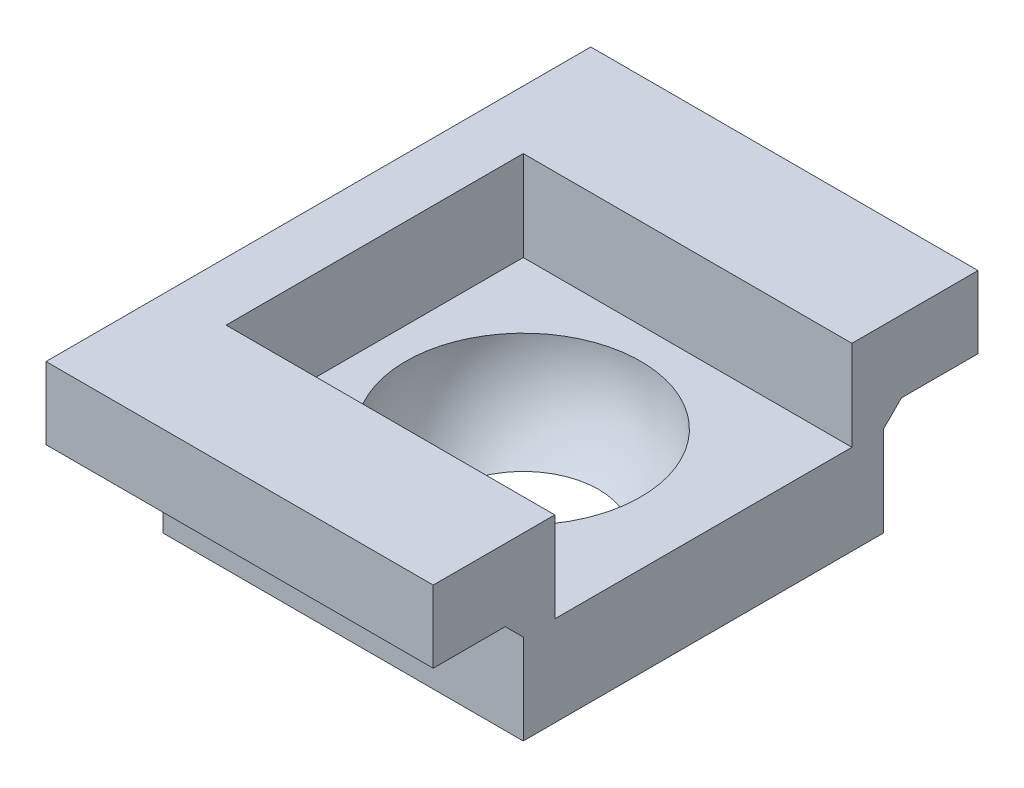
ISO-10303-21;
HEADER;
FILE_DESCRIPTION(('STEP AP214'),'2;1');
FILE_NAME('part.step','',(''),(''),'','','');
FILE_SCHEMA(('AUTOMOTIVE_DESIGN { 1 0 10303 214 1 1 1 1 }'));
ENDSEC;
DATA;
#1=APPLICATION_CONTEXT('core data for automotive mechanical design processes');
#2=APPLICATION_PROTOCOL_DEFINITION('international standard','automotive_design',2000,#1);
#3=PRODUCT_CONTEXT('',#1,'mechanical');
#4=PRODUCT('Part','Part','',(#3));
#5=PRODUCT_RELATED_PRODUCT_CATEGORY('part','',(#4));
#6=PRODUCT_DEFINITION_FORMATION('','',#4);
#7=PRODUCT_DEFINITION_CONTEXT('part definition',#1,'design');
#8=PRODUCT_DEFINITION('design','',#6,#7);
#9=PRODUCT_DEFINITION_SHAPE('','',#8);
#10=(LENGTH_UNIT() NAMED_UNIT(*) SI_UNIT(.MILLI.,.METRE.));
#11=(NAMED_UNIT(*) PLANE_ANGLE_UNIT() SI_UNIT($,.RADIAN.));
#12=(NAMED_UNIT(*) SI_UNIT($,.STERADIAN.) SOLID_ANGLE_UNIT());
#13=UNCERTAINTY_MEASURE_WITH_UNIT(LENGTH_MEASURE(1.E-05),#10,'distance_accuracy_value','');
#14=(GEOMETRIC_REPRESENTATION_CONTEXT(3) GLOBAL_UNCERTAINTY_ASSIGNED_CONTEXT((#13)) GLOBAL_UNIT_ASSIGNED_CONTEXT((#10,
#11,#12)) REPRESENTATION_CONTEXT('',''));
#15=CARTESIAN_POINT('',(0.,0.,0.));
#16=DIRECTION('',(0.,0.,1.));
#17=DIRECTION('',(1.,0.,0.));
#18=AXIS2_PLACEMENT_3D('',#15,#16,#17);
#19=CARTESIAN_POINT('',(-2.30598444461534,2.,-2.01602049593134));
#20=DIRECTION('',(1.,0.,0.));
#21=DIRECTION('',(0.,0.,-1.));
#22=AXIS2_PLACEMENT_3D('',#19,#20,#21);
#23=PLANE('',#22);
#24=DIRECTION('',(0.,0.,1.));
#25=VECTOR('',#24,1.);
#26=CARTESIAN_POINT('',(-2.30598444461534,2.2,-3.06602049593131));
#27=LINE('',#26,#25);
#28=CARTESIAN_POINT('',(-2.30598444461534,2.2,-2.21602049593134));
#29=VERTEX_POINT('',#28);
#30=CARTESIAN_POINT('',(-2.30598444461534,2.2,2.18397950406866));
#31=VERTEX_POINT('',#30);
#32=EDGE_CURVE('E45',#29,#31,#27,.T.);
#33=ORIENTED_EDGE('',*,*,#32,.F.);
#34=DIRECTION('',(0.,-0.707106781186548,0.707106781186548));
#35=VECTOR('',#34,1.);
#36=CARTESIAN_POINT('',(-2.30598444461534,2.,-2.01602049593134));
#37=LINE('',#36,#35);
#38=CARTESIAN_POINT('',(-2.30598444461534,2.,-2.01602049593134));
#39=VERTEX_POINT('',#38);
#40=EDGE_CURVE('E138',#29,#39,#37,.T.);
#41=ORIENTED_EDGE('',*,*,#40,.T.);
#42=DIRECTION('',(0.,-1.,0.));
#43=VECTOR('',#42,1.);
#44=CARTESIAN_POINT('',(-2.30598444461534,2.,-2.01602049593134));
#45=LINE('',#44,#43);
#46=CARTESIAN_POINT('',(-2.30598444461534,1.,-2.01602049593134));
#47=VERTEX_POINT('',#46);
#48=EDGE_CURVE('E57',#39,#47,#45,.T.);
#49=ORIENTED_EDGE('',*,*,#48,.T.);
#50=DIRECTION('',(0.,0.,-1.));
#51=VECTOR('',#50,1.);
#52=CARTESIAN_POINT('',(-2.30598444461534,1.,-2.01602049593134));
#53=LINE('',#52,#51);
#54=CARTESIAN_POINT('',(-2.30598444461534,1.,1.98397950406866));
#55=VERTEX_POINT('',#54);
#56=EDGE_CURVE('E239',#55,#47,#53,.T.);
#57=ORIENTED_EDGE('',*,*,#56,.F.);
#58=DIRECTION('',(0.,-1.,0.));
#59=VECTOR('',#58,1.);
#60=CARTESIAN_POINT('',(-2.30598444461534,2.,1.98397950406866));
#61=LINE('',#60,#59);
#62=CARTESIAN_POINT('',(-2.30598444461534,2.,1.98397950406866));
#63=VERTEX_POINT('',#62);
#64=EDGE_CURVE('E144',#63,#55,#61,.T.);
#65=ORIENTED_EDGE('',*,*,#64,.F.);
#66=DIRECTION('',(0.,0.707106781186548,0.707106781186548));
#67=VECTOR('',#66,1.);
#68=CARTESIAN_POINT('',(-2.30598444461534,2.,1.98397950406866));
#69=LINE('',#68,#67);
#70=EDGE_CURVE('E141',#63,#31,#69,.T.);
#71=ORIENTED_EDGE('',*,*,#70,.T.);
#72=EDGE_LOOP('',(#33,#41,#49,#57,#65,#71));
#73=FACE_BOUND('',#72,.T.);
#74=ADVANCED_FACE('F38',(#73),#23,.F.);
#75=CARTESIAN_POINT('',(-2.30598444461534,2.,1.98397950406866));
#76=DIRECTION('',(0.,0.,-1.));
#77=DIRECTION('',(-1.,0.,0.));
#78=AXIS2_PLACEMENT_3D('',#75,#76,#77);
#79=PLANE('',#78);
#80=DIRECTION('',(0.,-1.,0.));
#81=VECTOR('',#80,1.);
#82=CARTESIAN_POINT('',(1.69401555538466,2.,1.98397950406866));
#83=LINE('',#82,#81);
#84=CARTESIAN_POINT('',(1.69401555538466,2.,1.98397950406866));
#85=VERTEX_POINT('',#84);
#86=CARTESIAN_POINT('',(1.69401555538466,1.,1.98397950406866));
#87=VERTEX_POINT('',#86);
#88=EDGE_CURVE('E248',#85,#87,#83,.T.);
#89=ORIENTED_EDGE('',*,*,#88,.F.);
#90=DIRECTION('',(1.,0.,0.));
#91=VECTOR('',#90,1.);
#92=CARTESIAN_POINT('',(-2.58882715708996,2.,1.98397950406866));
#93=LINE('',#92,#91);
#94=EDGE_CURVE('E166',#63,#85,#93,.T.);
#95=ORIENTED_EDGE('',*,*,#94,.F.);
#96=ORIENTED_EDGE('',*,*,#64,.T.);
#97=DIRECTION('',(-1.,0.,0.));
#98=VECTOR('',#97,1.);
#99=CARTESIAN_POINT('',(-2.30598444461534,1.,1.98397950406866));
#100=LINE('',#99,#98);
#101=EDGE_CURVE('E236',#87,#55,#100,.T.);
#102=ORIENTED_EDGE('',*,*,#101,.F.);
#103=EDGE_LOOP('',(#89,#95,#96,#102));
#104=FACE_BOUND('',#103,.T.);
#105=ADVANCED_FACE('F269',(#104),#79,.F.);
#106=CARTESIAN_POINT('',(0.,2.,0.));
#107=DIRECTION('',(0.,1.,0.));
#108=DIRECTION('',(0.,0.,1.));
#109=AXIS2_PLACEMENT_3D('',#106,#107,#108);
#110=PLANE('',#109);
#111=DIRECTION('',(0.,0.,-1.));
#112=VECTOR('',#111,1.);
#113=CARTESIAN_POINT('',(1.69401555538466,2.,-2.01602049593134));
#114=LINE('',#113,#112);
#115=CARTESIAN_POINT('',(1.69401555538466,2.,1.63397950406866));
#116=VERTEX_POINT('',#115);
#117=CARTESIAN_POINT('',(1.69401555538466,2.,-1.66602049593134));
#118=VERTEX_POINT('',#117);
#119=EDGE_CURVE('E243',#116,#118,#114,.T.);
#120=ORIENTED_EDGE('',*,*,#119,.T.);
#121=DIRECTION('',(1.,0.,0.));
#122=VECTOR('',#121,1.);
#123=CARTESIAN_POINT('',(-1.95598444461534,2.,-1.66602049593134));
#124=LINE('',#123,#122);
#125=CARTESIAN_POINT('',(-1.95598444461534,2.,-1.66602049593134));
#126=VERTEX_POINT('',#125);
#127=EDGE_CURVE('E171',#126,#118,#124,.T.);
#128=ORIENTED_EDGE('',*,*,#127,.F.);
#129=DIRECTION('',(0.,0.,-1.));
#130=VECTOR('',#129,1.);
#131=CARTESIAN_POINT('',(-1.95598444461534,2.,1.63397950406866));
#132=LINE('',#131,#130);
#133=CARTESIAN_POINT('',(-1.95598444461534,2.,1.63397950406866));
#134=VERTEX_POINT('',#133);
#135=EDGE_CURVE('E174',#134,#126,#132,.T.);
#136=ORIENTED_EDGE('',*,*,#135,.F.);
#137=DIRECTION('',(-1.,0.,0.));
#138=VECTOR('',#137,1.);
#139=CARTESIAN_POINT('',(-1.95598444461534,2.,1.63397950406866));
#140=LINE('',#139,#138);
#141=EDGE_CURVE('E177',#116,#134,#140,.T.);
#142=ORIENTED_EDGE('',*,*,#141,.F.);
#143=EDGE_LOOP('',(#120,#128,#136,#142));
#144=FACE_BOUND('',#143,.T.);
#145=CARTESIAN_POINT('',(-0.305984444615342,2.,-0.0160204959313423));
#146=DIRECTION('',(0.,1.,0.));
#147=DIRECTION('',(0.,0.,1.));
#148=AXIS2_PLACEMENT_3D('',#145,#146,#147);
#149=CIRCLE('',#148,1.305);
#150=CARTESIAN_POINT('',(-0.305984444615342,2.,1.28897950406866));
#151=VERTEX_POINT('',#150);
#152=EDGE_CURVE('E242',#151,#151,#149,.F.);
#153=ORIENTED_EDGE('',*,*,#152,.T.);
#154=EDGE_LOOP('',(#153));
#155=FACE_BOUND('',#154,.T.);
#156=ADVANCED_FACE('F301',(#144,#155),#110,.T.);
#157=CARTESIAN_POINT('',(1.69401555538466,2.,-2.01602049593134));
#158=DIRECTION('',(-1.,0.,0.));
#159=DIRECTION('',(0.,0.,1.));
#160=AXIS2_PLACEMENT_3D('',#157,#158,#159);
#161=PLANE('',#160);
#162=DIRECTION('',(0.,-1.,0.));
#163=VECTOR('',#162,1.);
#164=CARTESIAN_POINT('',(1.69401555538466,2.,-2.01602049593134));
#165=LINE('',#164,#163);
#166=CARTESIAN_POINT('',(1.69401555538466,2.,-2.01602049593134));
#167=VERTEX_POINT('',#166);
#168=CARTESIAN_POINT('',(1.69401555538466,1.,-2.01602049593134));
#169=VERTEX_POINT('',#168);
#170=EDGE_CURVE('E246',#167,#169,#165,.T.);
#171=ORIENTED_EDGE('',*,*,#170,.F.);
#172=DIRECTION('',(0.,0.707106781186548,-0.707106781186548));
#173=VECTOR('',#172,1.);
#174=CARTESIAN_POINT('',(1.69401555538466,2.,-2.01602049593134));
#175=LINE('',#174,#173);
#176=CARTESIAN_POINT('',(1.69401555538492,2.2,-2.21602049593134));
#177=VERTEX_POINT('',#176);
#178=EDGE_CURVE('E162',#167,#177,#175,.T.);
#179=ORIENTED_EDGE('',*,*,#178,.T.);
#180=DIRECTION('',(0.,0.,1.));
#181=VECTOR('',#180,1.);
#182=CARTESIAN_POINT('',(1.69401555538492,2.2,-3.06602049593131));
#183=LINE('',#182,#181);
#184=CARTESIAN_POINT('',(1.69401555538492,2.2,-3.06602049593131));
#185=VERTEX_POINT('',#184);
#186=EDGE_CURVE('E150',#185,#177,#183,.T.);
#187=ORIENTED_EDGE('',*,*,#186,.F.);
#188=DIRECTION('',(0.,-1.,0.));
#189=VECTOR('',#188,1.);
#190=CARTESIAN_POINT('',(1.69401555538492,3.,-3.06602049593131));
#191=LINE('',#190,#189);
#192=CARTESIAN_POINT('',(1.69401555538492,3.,-3.06602049593131));
#193=VERTEX_POINT('',#192);
#194=EDGE_CURVE('E204',#193,#185,#191,.T.);
#195=ORIENTED_EDGE('',*,*,#194,.F.);
#196=DIRECTION('',(0.,0.,-1.));
#197=VECTOR('',#196,1.);
#198=CARTESIAN_POINT('',(1.69401555538492,3.,-1.61602049593134));
#199=LINE('',#198,#197);
#200=CARTESIAN_POINT('',(1.69401555538492,3.,-1.66602049593134));
#201=VERTEX_POINT('',#200);
#202=EDGE_CURVE('E224',#201,#193,#199,.T.);
#203=ORIENTED_EDGE('',*,*,#202,.F.);
#204=DIRECTION('',(0.,-1.,0.));
#205=VECTOR('',#204,1.);
#206=CARTESIAN_POINT('',(1.69401555538466,2.,-1.66602049593134));
#207=LINE('',#206,#205);
#208=EDGE_CURVE('E190',#201,#118,#207,.T.);
#209=ORIENTED_EDGE('',*,*,#208,.T.);
#210=ORIENTED_EDGE('',*,*,#119,.F.);
#211=DIRECTION('',(0.,1.,0.));
#212=VECTOR('',#211,1.);
#213=CARTESIAN_POINT('',(1.69401555538466,2.,1.63397950406866));
#214=LINE('',#213,#212);
#215=CARTESIAN_POINT('',(1.69401555538492,3.,1.63397950406866));
#216=VERTEX_POINT('',#215);
#217=EDGE_CURVE('E187',#116,#216,#214,.T.);
#218=ORIENTED_EDGE('',*,*,#217,.T.);
#219=DIRECTION('',(0.,0.,-1.));
#220=VECTOR('',#219,1.);
#221=CARTESIAN_POINT('',(1.69401555538492,3.,1.98397950406866));
#222=LINE('',#221,#220);
#223=CARTESIAN_POINT('',(1.69401555538492,3.,2.98397950406866));
#224=VERTEX_POINT('',#223);
#225=EDGE_CURVE('E226',#224,#216,#222,.T.);
#226=ORIENTED_EDGE('',*,*,#225,.F.);
#227=DIRECTION('',(0.,1.,0.));
#228=VECTOR('',#227,1.);
#229=CARTESIAN_POINT('',(1.69401555538492,3.,2.98397950406866));
#230=LINE('',#229,#228);
#231=CARTESIAN_POINT('',(1.69401555538492,2.2,2.98397950406866));
#232=VERTEX_POINT('',#231);
#233=EDGE_CURVE('E216',#232,#224,#230,.T.);
#234=ORIENTED_EDGE('',*,*,#233,.F.);
#235=DIRECTION('',(0.,0.,-1.));
#236=VECTOR('',#235,1.);
#237=CARTESIAN_POINT('',(1.69401555538492,2.2,2.98397950406866));
#238=LINE('',#237,#236);
#239=CARTESIAN_POINT('',(1.69401555538492,2.2,2.18397950406866));
#240=VERTEX_POINT('',#239);
#241=EDGE_CURVE('E221',#232,#240,#238,.T.);
#242=ORIENTED_EDGE('',*,*,#241,.T.);
#243=DIRECTION('',(0.,-0.707106781186548,-0.707106781186548));
#244=VECTOR('',#243,1.);
#245=CARTESIAN_POINT('',(1.69401555538466,2.,1.98397950406866));
#246=LINE('',#245,#244);
#247=EDGE_CURVE('E156',#240,#85,#246,.T.);
#248=ORIENTED_EDGE('',*,*,#247,.T.);
#249=ORIENTED_EDGE('',*,*,#88,.T.);
#250=DIRECTION('',(0.,0.,1.));
#251=VECTOR('',#250,1.);
#252=CARTESIAN_POINT('',(1.69401555538466,1.,-2.01602049593134));
#253=LINE('',#252,#251);
#254=EDGE_CURVE('E233',#169,#87,#253,.T.);
#255=ORIENTED_EDGE('',*,*,#254,.F.);
#256=EDGE_LOOP('',(#171,#179,#187,#195,#203,#209,#210,#218,#226,#234,#242,#248,#249,#255));
#257=FACE_BOUND('',#256,.T.);
#258=ADVANCED_FACE('F267',(#257),#161,.F.);
#259=CARTESIAN_POINT('',(-2.30598444461534,2.,-2.01602049593134));
#260=DIRECTION('',(0.,0.,1.));
#261=DIRECTION('',(1.,0.,0.));
#262=AXIS2_PLACEMENT_3D('',#259,#260,#261);
#263=PLANE('',#262);
#264=ORIENTED_EDGE('',*,*,#48,.F.);
#265=DIRECTION('',(1.,0.,0.));
#266=VECTOR('',#265,1.);
#267=CARTESIAN_POINT('',(-2.58882715708996,2.,-2.01602049593134));
#268=LINE('',#267,#266);
#269=EDGE_CURVE('E52',#39,#167,#268,.T.);
#270=ORIENTED_EDGE('',*,*,#269,.T.);
#271=ORIENTED_EDGE('',*,*,#170,.T.);
#272=DIRECTION('',(1.,0.,0.));
#273=VECTOR('',#272,1.);
#274=CARTESIAN_POINT('',(-2.30598444461534,1.,-2.01602049593134));
#275=LINE('',#274,#273);
#276=EDGE_CURVE('E230',#47,#169,#275,.T.);
#277=ORIENTED_EDGE('',*,*,#276,.F.);
#278=EDGE_LOOP('',(#264,#270,#271,#277));
#279=FACE_BOUND('',#278,.T.);
#280=ADVANCED_FACE('F265',(#279),#263,.F.);
#281=CARTESIAN_POINT('',(-0.305984444615342,2.,-0.0160204959313423));
#282=DIRECTION('',(0.,0.,1.));
#283=DIRECTION('',(-1.,0.,0.));
#284=AXIS2_PLACEMENT_3D('',#281,#282,#283);
#285=SPHERICAL_SURFACE('',#284,1.305);
#286=CARTESIAN_POINT('',(-0.305984444615342,2.,-0.0160204959313423));
#287=DIRECTION('',(0.,1.,0.));
#288=DIRECTION('',(0.,0.,1.));
#289=AXIS2_PLACEMENT_3D('',#286,#287,#288);
#290=SPHERICAL_SURFACE('',#289,1.305);
#291=ORIENTED_EDGE('',*,*,#152,.F.);
#292=EDGE_LOOP('',(#291));
#293=FACE_BOUND('',#292,.T.);
#294=CARTESIAN_POINT('',(-0.305984444615342,1.,-0.0160204959313423));
#295=DIRECTION('',(0.,-1.,0.));
#296=DIRECTION('',(0.,0.,-1.));
#297=AXIS2_PLACEMENT_3D('',#294,#295,#296);
#298=CIRCLE('',#297,0.838465860962747);
#299=CARTESIAN_POINT('',(-0.305984444615342,1.,-0.854486356894089));
#300=VERTEX_POINT('',#299);
#301=EDGE_CURVE('E229',#300,#300,#298,.T.);
#302=ORIENTED_EDGE('',*,*,#301,.T.);
#303=EDGE_LOOP('',(#302));
#304=FACE_BOUND('',#303,.T.);
#305=ADVANCED_FACE('F255',(#293,#304),#290,.F.);
#306=CARTESIAN_POINT('',(0.,1.,0.));
#307=DIRECTION('',(0.,-1.,0.));
#308=DIRECTION('',(0.,0.,-1.));
#309=AXIS2_PLACEMENT_3D('',#306,#307,#308);
#310=PLANE('',#309);
#311=ORIENTED_EDGE('',*,*,#301,.F.);
#312=EDGE_LOOP('',(#311));
#313=FACE_BOUND('',#312,.T.);
#314=ORIENTED_EDGE('',*,*,#56,.T.);
#315=ORIENTED_EDGE('',*,*,#276,.T.);
#316=ORIENTED_EDGE('',*,*,#254,.T.);
#317=ORIENTED_EDGE('',*,*,#101,.T.);
#318=EDGE_LOOP('',(#314,#315,#316,#317));
#319=FACE_BOUND('',#318,.T.);
#320=ADVANCED_FACE('F257',(#313,#319),#310,.T.);
#321=CARTESIAN_POINT('',(0.,3.,0.));
#322=DIRECTION('',(0.,-1.,0.));
#323=DIRECTION('',(0.,0.,-1.));
#324=AXIS2_PLACEMENT_3D('',#321,#322,#323);
#325=PLANE('',#324);
#326=DIRECTION('',(0.,0.,1.));
#327=VECTOR('',#326,1.);
#328=CARTESIAN_POINT('',(-1.95598444461534,3.,1.63397950406866));
#329=LINE('',#328,#327);
#330=CARTESIAN_POINT('',(-1.95598444461534,3.,-1.66602049593134));
#331=VERTEX_POINT('',#330);
#332=CARTESIAN_POINT('',(-1.95598444461534,3.,1.63397950406866));
#333=VERTEX_POINT('',#332);
#334=EDGE_CURVE('E165',#331,#333,#329,.T.);
#335=ORIENTED_EDGE('',*,*,#334,.F.);
#336=DIRECTION('',(1.,0.,0.));
#337=VECTOR('',#336,1.);
#338=CARTESIAN_POINT('',(0.,3.,-1.66602049593134));
#339=LINE('',#338,#337);
#340=EDGE_CURVE('E11',#331,#201,#339,.T.);
#341=ORIENTED_EDGE('',*,*,#340,.T.);
#342=ORIENTED_EDGE('',*,*,#202,.T.);
#343=DIRECTION('',(1.,0.,0.));
#344=VECTOR('',#343,1.);
#345=CARTESIAN_POINT('',(1.69401555538492,3.,-3.06602049593131));
#346=LINE('',#345,#344);
#347=CARTESIAN_POINT('',(-2.60598444461534,3.,-3.06602049593131));
#348=VERTEX_POINT('',#347);
#349=EDGE_CURVE('E210',#348,#193,#346,.T.);
#350=ORIENTED_EDGE('',*,*,#349,.F.);
#351=DIRECTION('',(0.,0.,-1.));
#352=VECTOR('',#351,1.);
#353=CARTESIAN_POINT('',(-2.60598444461534,3.,-3.06602049593131));
#354=LINE('',#353,#352);
#355=CARTESIAN_POINT('',(-2.60598444461534,3.,2.98397950406866));
#356=VERTEX_POINT('',#355);
#357=EDGE_CURVE('E202',#356,#348,#354,.T.);
#358=ORIENTED_EDGE('',*,*,#357,.F.);
#359=DIRECTION('',(-1.,0.,0.));
#360=VECTOR('',#359,1.);
#361=CARTESIAN_POINT('',(-2.30598444461534,3.,2.98397950406866));
#362=LINE('',#361,#360);
#363=EDGE_CURVE('E219',#224,#356,#362,.T.);
#364=ORIENTED_EDGE('',*,*,#363,.F.);
#365=ORIENTED_EDGE('',*,*,#225,.T.);
#366=DIRECTION('',(1.,0.,0.));
#367=VECTOR('',#366,1.);
#368=CARTESIAN_POINT('',(-1.95598444461534,3.,1.63397950406866));
#369=LINE('',#368,#367);
#370=EDGE_CURVE('E179',#333,#216,#369,.T.);
#371=ORIENTED_EDGE('',*,*,#370,.F.);
#372=EDGE_LOOP('',(#335,#341,#342,#350,#358,#364,#365,#371));
#373=FACE_BOUND('',#372,.T.);
#374=ADVANCED_FACE('F260',(#373),#325,.F.);
#375=CARTESIAN_POINT('',(-2.30598444461534,2.2,2.98397950406866));
#376=DIRECTION('',(0.,1.,0.));
#377=DIRECTION('',(0.,0.,1.));
#378=AXIS2_PLACEMENT_3D('',#375,#376,#377);
#379=PLANE('',#378);
#380=ORIENTED_EDGE('',*,*,#186,.T.);
#381=DIRECTION('',(1.,0.,0.));
#382=VECTOR('',#381,1.);
#383=CARTESIAN_POINT('',(-2.58882715708996,2.2,-2.21602049593134));
#384=LINE('',#383,#382);
#385=EDGE_CURVE('E147',#29,#177,#384,.T.);
#386=ORIENTED_EDGE('',*,*,#385,.F.);
#387=ORIENTED_EDGE('',*,*,#32,.T.);
#388=DIRECTION('',(1.,0.,0.));
#389=VECTOR('',#388,1.);
#390=CARTESIAN_POINT('',(-2.58882715708996,2.2,2.18397950406866));
#391=LINE('',#390,#389);
#392=EDGE_CURVE('E159',#31,#240,#391,.T.);
#393=ORIENTED_EDGE('',*,*,#392,.T.);
#394=ORIENTED_EDGE('',*,*,#241,.F.);
#395=DIRECTION('',(1.,0.,0.));
#396=VECTOR('',#395,1.);
#397=CARTESIAN_POINT('',(-2.30598444461534,2.2,2.98397950406866));
#398=LINE('',#397,#396);
#399=CARTESIAN_POINT('',(-2.60598444461534,2.2,2.98397950406866));
#400=VERTEX_POINT('',#399);
#401=EDGE_CURVE('E214',#400,#232,#398,.T.);
#402=ORIENTED_EDGE('',*,*,#401,.F.);
#403=DIRECTION('',(0.,0.,1.));
#404=VECTOR('',#403,1.);
#405=CARTESIAN_POINT('',(-2.60598444461534,2.2,-3.06602049593131));
#406=LINE('',#405,#404);
#407=CARTESIAN_POINT('',(-2.60598444461534,2.2,-3.06602049593131));
#408=VERTEX_POINT('',#407);
#409=EDGE_CURVE('E196',#408,#400,#406,.T.);
#410=ORIENTED_EDGE('',*,*,#409,.F.);
#411=DIRECTION('',(-1.,0.,0.));
#412=VECTOR('',#411,1.);
#413=CARTESIAN_POINT('',(1.69401555538492,2.2,-3.06602049593131));
#414=LINE('',#413,#412);
#415=EDGE_CURVE('E208',#185,#408,#414,.T.);
#416=ORIENTED_EDGE('',*,*,#415,.F.);
#417=EDGE_LOOP('',(#380,#386,#387,#393,#394,#402,#410,#416));
#418=FACE_BOUND('',#417,.T.);
#419=ADVANCED_FACE('F148',(#418),#379,.F.);
#420=CARTESIAN_POINT('',(0.,0.,2.98397950406866));
#421=DIRECTION('',(0.,0.,1.));
#422=DIRECTION('',(1.,0.,0.));
#423=AXIS2_PLACEMENT_3D('',#420,#421,#422);
#424=PLANE('',#423);
#425=ORIENTED_EDGE('',*,*,#363,.T.);
#426=DIRECTION('',(0.,1.,0.));
#427=VECTOR('',#426,1.);
#428=CARTESIAN_POINT('',(-2.60598444461534,3.,2.98397950406866));
#429=LINE('',#428,#427);
#430=EDGE_CURVE('E199',#400,#356,#429,.T.);
#431=ORIENTED_EDGE('',*,*,#430,.F.);
#432=ORIENTED_EDGE('',*,*,#401,.T.);
#433=ORIENTED_EDGE('',*,*,#233,.T.);
#434=EDGE_LOOP('',(#425,#431,#432,#433));
#435=FACE_BOUND('',#434,.T.);
#436=ADVANCED_FACE('F277',(#435),#424,.T.);
#437=CARTESIAN_POINT('',(0.,0.,-3.06602049593131));
#438=DIRECTION('',(0.,0.,-1.));
#439=DIRECTION('',(-1.,0.,0.));
#440=AXIS2_PLACEMENT_3D('',#437,#438,#439);
#441=PLANE('',#440);
#442=ORIENTED_EDGE('',*,*,#194,.T.);
#443=ORIENTED_EDGE('',*,*,#415,.T.);
#444=DIRECTION('',(0.,-1.,0.));
#445=VECTOR('',#444,1.);
#446=CARTESIAN_POINT('',(-2.60598444461534,3.,-3.06602049593131));
#447=LINE('',#446,#445);
#448=EDGE_CURVE('E193',#348,#408,#447,.T.);
#449=ORIENTED_EDGE('',*,*,#448,.F.);
#450=ORIENTED_EDGE('',*,*,#349,.T.);
#451=EDGE_LOOP('',(#442,#443,#449,#450));
#452=FACE_BOUND('',#451,.T.);
#453=ADVANCED_FACE('F287',(#452),#441,.T.);
#454=CARTESIAN_POINT('',(-2.60598444461534,0.,0.));
#455=DIRECTION('',(-1.,0.,0.));
#456=DIRECTION('',(0.,0.,1.));
#457=AXIS2_PLACEMENT_3D('',#454,#455,#456);
#458=PLANE('',#457);
#459=ORIENTED_EDGE('',*,*,#448,.T.);
#460=ORIENTED_EDGE('',*,*,#409,.T.);
#461=ORIENTED_EDGE('',*,*,#430,.T.);
#462=ORIENTED_EDGE('',*,*,#357,.T.);
#463=EDGE_LOOP('',(#459,#460,#461,#462));
#464=FACE_BOUND('',#463,.T.);
#465=ADVANCED_FACE('F285',(#464),#458,.T.);
#466=CARTESIAN_POINT('',(-1.95598444461534,-3.22559643835036,-1.66602049593134));
#467=DIRECTION('',(0.,0.,-1.));
#468=DIRECTION('',(-1.,0.,0.));
#469=AXIS2_PLACEMENT_3D('',#466,#467,#468);
#470=PLANE('',#469);
#471=ORIENTED_EDGE('',*,*,#340,.F.);
#472=DIRECTION('',(0.,1.,0.));
#473=VECTOR('',#472,1.);
#474=CARTESIAN_POINT('',(-1.95598444461534,-3.22559643835036,-1.66602049593134));
#475=LINE('',#474,#473);
#476=EDGE_CURVE('E175',#126,#331,#475,.T.);
#477=ORIENTED_EDGE('',*,*,#476,.F.);
#478=ORIENTED_EDGE('',*,*,#127,.T.);
#479=ORIENTED_EDGE('',*,*,#208,.F.);
#480=EDGE_LOOP('',(#471,#477,#478,#479));
#481=FACE_BOUND('',#480,.T.);
#482=ADVANCED_FACE('F293',(#481),#470,.F.);
#483=CARTESIAN_POINT('',(-1.95598444461534,-3.22559643835036,1.63397950406866));
#484=DIRECTION('',(0.,0.,1.));
#485=DIRECTION('',(1.,0.,0.));
#486=AXIS2_PLACEMENT_3D('',#483,#484,#485);
#487=PLANE('',#486);
#488=ORIENTED_EDGE('',*,*,#141,.T.);
#489=DIRECTION('',(0.,1.,0.));
#490=VECTOR('',#489,1.);
#491=CARTESIAN_POINT('',(-1.95598444461534,-3.22559643835036,1.63397950406866));
#492=LINE('',#491,#490);
#493=EDGE_CURVE('E181',#134,#333,#492,.T.);
#494=ORIENTED_EDGE('',*,*,#493,.T.);
#495=ORIENTED_EDGE('',*,*,#370,.T.);
#496=ORIENTED_EDGE('',*,*,#217,.F.);
#497=EDGE_LOOP('',(#488,#494,#495,#496));
#498=FACE_BOUND('',#497,.T.);
#499=ADVANCED_FACE('F305',(#498),#487,.F.);
#500=CARTESIAN_POINT('',(-1.95598444461534,-3.22559643835036,1.63397950406866));
#501=DIRECTION('',(-1.,0.,0.));
#502=DIRECTION('',(0.,0.,1.));
#503=AXIS2_PLACEMENT_3D('',#500,#501,#502);
#504=PLANE('',#503);
#505=ORIENTED_EDGE('',*,*,#135,.T.);
#506=ORIENTED_EDGE('',*,*,#476,.T.);
#507=ORIENTED_EDGE('',*,*,#334,.T.);
#508=ORIENTED_EDGE('',*,*,#493,.F.);
#509=EDGE_LOOP('',(#505,#506,#507,#508));
#510=FACE_BOUND('',#509,.T.);
#511=ADVANCED_FACE('F295',(#510),#504,.F.);
#512=CARTESIAN_POINT('',(-2.58882715708996,2.,1.98397950406866));
#513=DIRECTION('',(0.,-0.707106781186547,0.707106781186547));
#514=DIRECTION('',(0.,-0.707106781186548,-0.707106781186548));
#515=AXIS2_PLACEMENT_3D('',#512,#513,#514);
#516=PLANE('',#515);
#517=ORIENTED_EDGE('',*,*,#70,.F.);
#518=ORIENTED_EDGE('',*,*,#94,.T.);
#519=ORIENTED_EDGE('',*,*,#247,.F.);
#520=ORIENTED_EDGE('',*,*,#392,.F.);
#521=EDGE_LOOP('',(#517,#518,#519,#520));
#522=FACE_BOUND('',#521,.T.);
#523=ADVANCED_FACE('F271',(#522),#516,.T.);
#524=CARTESIAN_POINT('',(-2.58882715708996,2.,-2.01602049593134));
#525=DIRECTION('',(0.,-0.707106781186547,-0.707106781186547));
#526=DIRECTION('',(0.,0.707106781186548,-0.707106781186548));
#527=AXIS2_PLACEMENT_3D('',#524,#525,#526);
#528=PLANE('',#527);
#529=ORIENTED_EDGE('',*,*,#40,.F.);
#530=ORIENTED_EDGE('',*,*,#385,.T.);
#531=ORIENTED_EDGE('',*,*,#178,.F.);
#532=ORIENTED_EDGE('',*,*,#269,.F.);
#533=EDGE_LOOP('',(#529,#530,#531,#532));
#534=FACE_BOUND('',#533,.T.);
#535=ADVANCED_FACE('F155',(#534),#528,.T.);
#536=CLOSED_SHELL('',(#74,#105,#156,#258,#280,#305,#320,#374,#419,#436,#453,#465,#482,#499,#511,
#523,#535));
#537=MANIFOLD_SOLID_BREP('B2',#536);
#538=ADVANCED_BREP_SHAPE_REPRESENTATION('',(#18,#537),#14);
#539=SHAPE_DEFINITION_REPRESENTATION(#9,#538);
ENDSEC;
END-ISO-10303-21;
